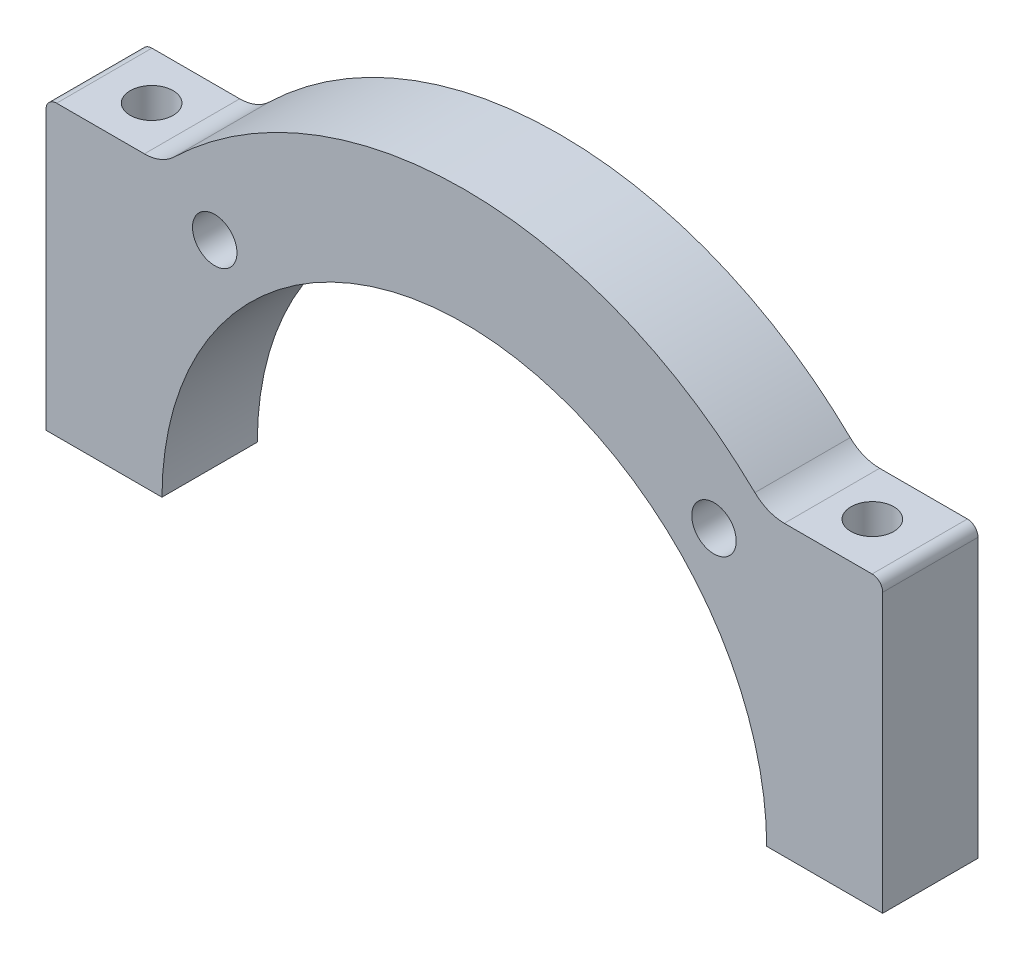
ISO-10303-21;
HEADER;
FILE_DESCRIPTION(('STEP AP214'),'2;1');
FILE_NAME('part.step','',(''),(''),'','','');
FILE_SCHEMA(('AUTOMOTIVE_DESIGN { 1 0 10303 214 1 1 1 1 }'));
ENDSEC;
DATA;
#1=APPLICATION_CONTEXT('core data for automotive mechanical design processes');
#2=APPLICATION_PROTOCOL_DEFINITION('international standard','automotive_design',2000,#1);
#3=PRODUCT_CONTEXT('',#1,'mechanical');
#4=PRODUCT('Part','Part','',(#3));
#5=PRODUCT_RELATED_PRODUCT_CATEGORY('part','',(#4));
#6=PRODUCT_DEFINITION_FORMATION('','',#4);
#7=PRODUCT_DEFINITION_CONTEXT('part definition',#1,'design');
#8=PRODUCT_DEFINITION('design','',#6,#7);
#9=PRODUCT_DEFINITION_SHAPE('','',#8);
#10=(LENGTH_UNIT() NAMED_UNIT(*) SI_UNIT(.MILLI.,.METRE.));
#11=(NAMED_UNIT(*) PLANE_ANGLE_UNIT() SI_UNIT($,.RADIAN.));
#12=(NAMED_UNIT(*) SI_UNIT($,.STERADIAN.) SOLID_ANGLE_UNIT());
#13=UNCERTAINTY_MEASURE_WITH_UNIT(LENGTH_MEASURE(1.E-05),#10,'distance_accuracy_value','');
#14=(GEOMETRIC_REPRESENTATION_CONTEXT(3) GLOBAL_UNCERTAINTY_ASSIGNED_CONTEXT((#13)) GLOBAL_UNIT_ASSIGNED_CONTEXT((#10,
#11,#12)) REPRESENTATION_CONTEXT('',''));
#15=CARTESIAN_POINT('',(0.,0.,0.));
#16=DIRECTION('',(0.,0.,1.));
#17=DIRECTION('',(1.,0.,0.));
#18=AXIS2_PLACEMENT_3D('',#15,#16,#17);
#19=CARTESIAN_POINT('',(34.025,123.51,-4.5));
#20=DIRECTION('',(0.,-1.,0.));
#21=DIRECTION('',(0.,0.,-1.));
#22=AXIS2_PLACEMENT_3D('',#19,#20,#21);
#23=CYLINDRICAL_SURFACE('',#22,2.025);
#24=CARTESIAN_POINT('',(34.025,0.0499999999999945,-4.5));
#25=DIRECTION('',(0.,1.,0.));
#26=DIRECTION('',(-1.,0.,0.));
#27=AXIS2_PLACEMENT_3D('',#24,#25,#26);
#28=CIRCLE('',#27,2.025);
#29=CARTESIAN_POINT('',(32.,0.0499999999999942,-4.5));
#30=VERTEX_POINT('',#29);
#31=EDGE_CURVE('E218',#30,#30,#28,.T.);
#32=ORIENTED_EDGE('',*,*,#31,.F.);
#33=EDGE_LOOP('',(#32));
#34=FACE_BOUND('',#33,.T.);
#35=CARTESIAN_POINT('',(34.025,27.2973899851249,-4.5));
#36=DIRECTION('',(0.,1.,0.));
#37=DIRECTION('',(0.,0.,1.));
#38=AXIS2_PLACEMENT_3D('',#35,#36,#37);
#39=CIRCLE('',#38,2.025);
#40=CARTESIAN_POINT('',(34.025,27.2973899851249,-2.475));
#41=VERTEX_POINT('',#40);
#42=EDGE_CURVE('E204',#41,#41,#39,.T.);
#43=ORIENTED_EDGE('',*,*,#42,.T.);
#44=EDGE_LOOP('',(#43));
#45=FACE_BOUND('',#44,.T.);
#46=ADVANCED_FACE('F16',(#34,#45),#23,.F.);
#47=CARTESIAN_POINT('',(-34.025,123.51,-4.5));
#48=DIRECTION('',(0.,-1.,0.));
#49=DIRECTION('',(0.,0.,-1.));
#50=AXIS2_PLACEMENT_3D('',#47,#48,#49);
#51=CYLINDRICAL_SURFACE('',#50,2.025);
#52=CARTESIAN_POINT('',(-34.025,27.2973899851249,-4.5));
#53=DIRECTION('',(0.,-1.,0.));
#54=DIRECTION('',(0.,0.,-1.));
#55=AXIS2_PLACEMENT_3D('',#52,#53,#54);
#56=CIRCLE('',#55,2.025);
#57=CARTESIAN_POINT('',(-34.025,27.2973899851249,-6.525));
#58=VERTEX_POINT('',#57);
#59=EDGE_CURVE('E178',#58,#58,#56,.T.);
#60=ORIENTED_EDGE('',*,*,#59,.F.);
#61=EDGE_LOOP('',(#60));
#62=FACE_BOUND('',#61,.T.);
#63=CARTESIAN_POINT('',(-34.025,0.0499999999999945,-4.5));
#64=DIRECTION('',(0.,-1.,0.));
#65=DIRECTION('',(0.,0.,-1.));
#66=AXIS2_PLACEMENT_3D('',#63,#64,#65);
#67=CIRCLE('',#66,2.025);
#68=CARTESIAN_POINT('',(-34.025,0.0499999999999945,-6.525));
#69=VERTEX_POINT('',#68);
#70=EDGE_CURVE('E249',#69,#69,#67,.T.);
#71=ORIENTED_EDGE('',*,*,#70,.T.);
#72=EDGE_LOOP('',(#71));
#73=FACE_BOUND('',#72,.T.);
#74=ADVANCED_FACE('F549',(#62,#73),#51,.F.);
#75=CARTESIAN_POINT('',(0.,-12.25,0.));
#76=DIRECTION('',(0.,0.,1.));
#77=DIRECTION('',(1.,0.,0.));
#78=AXIS2_PLACEMENT_3D('',#75,#76,#77);
#79=PLANE('',#78);
#80=CARTESIAN_POINT('',(23.57,23.57,0.));
#81=DIRECTION('',(0.,0.,1.));
#82=DIRECTION('',(1.,0.,0.));
#83=AXIS2_PLACEMENT_3D('',#80,#81,#82);
#84=CIRCLE('',#83,2.1);
#85=CARTESIAN_POINT('',(25.67,23.57,0.));
#86=VERTEX_POINT('',#85);
#87=EDGE_CURVE('E11',#86,#86,#84,.T.);
#88=ORIENTED_EDGE('',*,*,#87,.F.);
#89=EDGE_LOOP('',(#88));
#90=FACE_BOUND('',#89,.T.);
#91=CARTESIAN_POINT('',(-23.57,23.57,0.));
#92=DIRECTION('',(0.,0.,1.));
#93=DIRECTION('',(1.,0.,0.));
#94=AXIS2_PLACEMENT_3D('',#91,#92,#93);
#95=CIRCLE('',#94,2.1);
#96=CARTESIAN_POINT('',(-21.47,23.57,0.));
#97=VERTEX_POINT('',#96);
#98=EDGE_CURVE('E205',#97,#97,#95,.T.);
#99=ORIENTED_EDGE('',*,*,#98,.F.);
#100=EDGE_LOOP('',(#99));
#101=FACE_BOUND('',#100,.T.);
#102=DIRECTION('',(0.,1.,0.));
#103=VECTOR('',#102,1.);
#104=CARTESIAN_POINT('',(-39.4999683544177,13.1736949925625,0.));
#105=LINE('',#104,#103);
#106=CARTESIAN_POINT('',(-39.4999683544177,0.0499999999976821,0.));
#107=VERTEX_POINT('',#106);
#108=CARTESIAN_POINT('',(-39.4999683544177,26.2973899851249,0.));
#109=VERTEX_POINT('',#108);
#110=EDGE_CURVE('E213',#107,#109,#105,.T.);
#111=ORIENTED_EDGE('',*,*,#110,.F.);
#112=DIRECTION('',(1.,0.,0.));
#113=VECTOR('',#112,1.);
#114=CARTESIAN_POINT('',(-34.0249622857735,0.05,0.));
#115=LINE('',#114,#113);
#116=CARTESIAN_POINT('',(-28.5499562171293,0.05,0.));
#117=VERTEX_POINT('',#116);
#118=EDGE_CURVE('E252',#107,#117,#115,.T.);
#119=ORIENTED_EDGE('',*,*,#118,.T.);
#120=CARTESIAN_POINT('',(-9.1919527545059E-11,0.,0.));
#121=DIRECTION('',(0.,0.,1.));
#122=DIRECTION('',(1.,0.,0.));
#123=AXIS2_PLACEMENT_3D('',#120,#121,#122);
#124=CIRCLE('',#123,28.55);
#125=CARTESIAN_POINT('',(28.5499562171293,0.05,0.));
#126=VERTEX_POINT('',#125);
#127=EDGE_CURVE('E284',#126,#117,#124,.T.);
#128=ORIENTED_EDGE('',*,*,#127,.F.);
#129=DIRECTION('',(-1.,0.,0.));
#130=VECTOR('',#129,1.);
#131=CARTESIAN_POINT('',(34.0249622857735,0.05,0.));
#132=LINE('',#131,#130);
#133=CARTESIAN_POINT('',(39.4999683544177,0.050000000002007,0.));
#134=VERTEX_POINT('',#133);
#135=EDGE_CURVE('E223',#134,#126,#132,.T.);
#136=ORIENTED_EDGE('',*,*,#135,.F.);
#137=DIRECTION('',(0.,1.,0.));
#138=VECTOR('',#137,1.);
#139=CARTESIAN_POINT('',(39.4999683544177,13.1736949925625,0.));
#140=LINE('',#139,#138);
#141=CARTESIAN_POINT('',(39.4999683544177,26.2973899851249,0.));
#142=VERTEX_POINT('',#141);
#143=EDGE_CURVE('E245',#134,#142,#140,.T.);
#144=ORIENTED_EDGE('',*,*,#143,.T.);
#145=CARTESIAN_POINT('',(38.4999683544177,26.2973899851249,0.));
#146=DIRECTION('',(0.,0.,-1.));
#147=DIRECTION('',(1.,0.,0.));
#148=AXIS2_PLACEMENT_3D('',#145,#146,#147);
#149=CIRCLE('',#148,1.);
#150=CARTESIAN_POINT('',(38.4999683544177,27.2973899851249,0.));
#151=VERTEX_POINT('',#150);
#152=EDGE_CURVE('E226',#151,#142,#149,.T.);
#153=ORIENTED_EDGE('',*,*,#152,.F.);
#154=DIRECTION('',(-1.,0.,0.));
#155=VECTOR('',#154,1.);
#156=CARTESIAN_POINT('',(34.3556402380938,27.2973899851249,0.));
#157=LINE('',#156,#155);
#158=CARTESIAN_POINT('',(30.2113121217699,27.2973899851249,0.));
#159=VERTEX_POINT('',#158);
#160=EDGE_CURVE('E199',#151,#159,#157,.T.);
#161=ORIENTED_EDGE('',*,*,#160,.T.);
#162=CARTESIAN_POINT('',(30.2113121217699,31.2973899851249,0.));
#163=DIRECTION('',(0.,0.,-1.));
#164=DIRECTION('',(1.,0.,0.));
#165=AXIS2_PLACEMENT_3D('',#162,#163,#164);
#166=CIRCLE('',#165,4.);
#167=CARTESIAN_POINT('',(27.4332604324117,28.4194690669526,0.));
#168=VERTEX_POINT('',#167);
#169=EDGE_CURVE('E258',#159,#168,#166,.T.);
#170=ORIENTED_EDGE('',*,*,#169,.T.);
#171=CARTESIAN_POINT('',(0.,0.,0.));
#172=DIRECTION('',(0.,0.,1.));
#173=DIRECTION('',(1.,0.,0.));
#174=AXIS2_PLACEMENT_3D('',#171,#172,#173);
#175=CIRCLE('',#174,39.5);
#176=CARTESIAN_POINT('',(-27.4332604324117,28.4194690669526,0.));
#177=VERTEX_POINT('',#176);
#178=EDGE_CURVE('E234',#168,#177,#175,.T.);
#179=ORIENTED_EDGE('',*,*,#178,.T.);
#180=CARTESIAN_POINT('',(-30.2113121217699,31.2973899851249,0.));
#181=DIRECTION('',(0.,0.,1.));
#182=DIRECTION('',(1.,0.,0.));
#183=AXIS2_PLACEMENT_3D('',#180,#181,#182);
#184=CIRCLE('',#183,4.);
#185=CARTESIAN_POINT('',(-30.2113121217699,27.2973899851249,0.));
#186=VERTEX_POINT('',#185);
#187=EDGE_CURVE('E132',#186,#177,#184,.T.);
#188=ORIENTED_EDGE('',*,*,#187,.F.);
#189=DIRECTION('',(1.,0.,0.));
#190=VECTOR('',#189,1.);
#191=CARTESIAN_POINT('',(-34.3556402380938,27.2973899851249,0.));
#192=LINE('',#191,#190);
#193=CARTESIAN_POINT('',(-38.4999683544177,27.2973899851249,0.));
#194=VERTEX_POINT('',#193);
#195=EDGE_CURVE('E182',#194,#186,#192,.T.);
#196=ORIENTED_EDGE('',*,*,#195,.F.);
#197=CARTESIAN_POINT('',(-38.4999683544177,26.2973899851249,0.));
#198=DIRECTION('',(0.,0.,1.));
#199=DIRECTION('',(1.,0.,0.));
#200=AXIS2_PLACEMENT_3D('',#197,#198,#199);
#201=CIRCLE('',#200,1.00000000000002);
#202=EDGE_CURVE('E171',#194,#109,#201,.T.);
#203=ORIENTED_EDGE('',*,*,#202,.T.);
#204=EDGE_LOOP('',(#111,#119,#128,#136,#144,#153,#161,#170,#179,#188,#196,#203));
#205=FACE_BOUND('',#204,.T.);
#206=ADVANCED_FACE('F366',(#90,#101,#205),#79,.T.);
#207=CARTESIAN_POINT('',(0.,-12.25,-9.));
#208=DIRECTION('',(0.,0.,1.));
#209=DIRECTION('',(1.,0.,0.));
#210=AXIS2_PLACEMENT_3D('',#207,#208,#209);
#211=PLANE('',#210);
#212=CARTESIAN_POINT('',(23.57,23.57,-9.));
#213=DIRECTION('',(0.,0.,1.));
#214=DIRECTION('',(1.,0.,0.));
#215=AXIS2_PLACEMENT_3D('',#212,#213,#214);
#216=CIRCLE('',#215,2.1);
#217=CARTESIAN_POINT('',(25.67,23.57,-9.));
#218=VERTEX_POINT('',#217);
#219=EDGE_CURVE('E27',#218,#218,#216,.T.);
#220=ORIENTED_EDGE('',*,*,#219,.T.);
#221=EDGE_LOOP('',(#220));
#222=FACE_BOUND('',#221,.T.);
#223=CARTESIAN_POINT('',(-23.57,23.57,-9.));
#224=DIRECTION('',(0.,0.,1.));
#225=DIRECTION('',(1.,0.,0.));
#226=AXIS2_PLACEMENT_3D('',#223,#224,#225);
#227=CIRCLE('',#226,2.1);
#228=CARTESIAN_POINT('',(-21.47,23.57,-9.));
#229=VERTEX_POINT('',#228);
#230=EDGE_CURVE('E208',#229,#229,#227,.T.);
#231=ORIENTED_EDGE('',*,*,#230,.T.);
#232=EDGE_LOOP('',(#231));
#233=FACE_BOUND('',#232,.T.);
#234=DIRECTION('',(0.,1.,0.));
#235=VECTOR('',#234,1.);
#236=CARTESIAN_POINT('',(-39.4999683544177,13.1736949925625,-9.));
#237=LINE('',#236,#235);
#238=CARTESIAN_POINT('',(-39.4999683544177,0.0499999999976821,-9.));
#239=VERTEX_POINT('',#238);
#240=CARTESIAN_POINT('',(-39.4999683544177,26.2973899851249,-9.));
#241=VERTEX_POINT('',#240);
#242=EDGE_CURVE('E212',#239,#241,#237,.T.);
#243=ORIENTED_EDGE('',*,*,#242,.T.);
#244=CARTESIAN_POINT('',(-38.4999683544177,26.2973899851249,-9.));
#245=DIRECTION('',(0.,0.,1.));
#246=DIRECTION('',(1.,0.,0.));
#247=AXIS2_PLACEMENT_3D('',#244,#245,#246);
#248=CIRCLE('',#247,1.00000000000002);
#249=CARTESIAN_POINT('',(-38.4999683544177,27.2973899851249,-9.));
#250=VERTEX_POINT('',#249);
#251=EDGE_CURVE('E222',#250,#241,#248,.T.);
#252=ORIENTED_EDGE('',*,*,#251,.F.);
#253=DIRECTION('',(1.,0.,0.));
#254=VECTOR('',#253,1.);
#255=CARTESIAN_POINT('',(-34.3556402380938,27.2973899851249,-9.));
#256=LINE('',#255,#254);
#257=CARTESIAN_POINT('',(-30.2113121217699,27.2973899851249,-9.));
#258=VERTEX_POINT('',#257);
#259=EDGE_CURVE('E190',#250,#258,#256,.T.);
#260=ORIENTED_EDGE('',*,*,#259,.T.);
#261=CARTESIAN_POINT('',(-30.2113121217699,31.2973899851249,-9.));
#262=DIRECTION('',(0.,0.,1.));
#263=DIRECTION('',(1.,0.,0.));
#264=AXIS2_PLACEMENT_3D('',#261,#262,#263);
#265=CIRCLE('',#264,4.);
#266=CARTESIAN_POINT('',(-27.4332604324117,28.4194690669526,-9.));
#267=VERTEX_POINT('',#266);
#268=EDGE_CURVE('E193',#258,#267,#265,.T.);
#269=ORIENTED_EDGE('',*,*,#268,.T.);
#270=CARTESIAN_POINT('',(0.,0.,-9.));
#271=DIRECTION('',(0.,0.,1.));
#272=DIRECTION('',(1.,0.,0.));
#273=AXIS2_PLACEMENT_3D('',#270,#271,#272);
#274=CIRCLE('',#273,39.5);
#275=CARTESIAN_POINT('',(27.4332604324117,28.4194690669526,-9.));
#276=VERTEX_POINT('',#275);
#277=EDGE_CURVE('E122',#276,#267,#274,.T.);
#278=ORIENTED_EDGE('',*,*,#277,.F.);
#279=CARTESIAN_POINT('',(30.2113121217699,31.2973899851249,-9.));
#280=DIRECTION('',(0.,0.,-1.));
#281=DIRECTION('',(1.,0.,0.));
#282=AXIS2_PLACEMENT_3D('',#279,#280,#281);
#283=CIRCLE('',#282,4.);
#284=CARTESIAN_POINT('',(30.2113121217699,27.2973899851249,-9.));
#285=VERTEX_POINT('',#284);
#286=EDGE_CURVE('E278',#285,#276,#283,.T.);
#287=ORIENTED_EDGE('',*,*,#286,.F.);
#288=DIRECTION('',(-1.,0.,0.));
#289=VECTOR('',#288,1.);
#290=CARTESIAN_POINT('',(34.3556402380938,27.2973899851249,-9.));
#291=LINE('',#290,#289);
#292=CARTESIAN_POINT('',(38.4999683544177,27.2973899851249,-9.));
#293=VERTEX_POINT('',#292);
#294=EDGE_CURVE('E203',#293,#285,#291,.T.);
#295=ORIENTED_EDGE('',*,*,#294,.F.);
#296=CARTESIAN_POINT('',(38.4999683544177,26.2973899851249,-9.));
#297=DIRECTION('',(0.,0.,-1.));
#298=DIRECTION('',(1.,0.,0.));
#299=AXIS2_PLACEMENT_3D('',#296,#297,#298);
#300=CIRCLE('',#299,1.);
#301=CARTESIAN_POINT('',(39.4999683544177,26.2973899851249,-9.));
#302=VERTEX_POINT('',#301);
#303=EDGE_CURVE('E229',#293,#302,#300,.T.);
#304=ORIENTED_EDGE('',*,*,#303,.T.);
#305=DIRECTION('',(0.,1.,0.));
#306=VECTOR('',#305,1.);
#307=CARTESIAN_POINT('',(39.4999683544177,13.1736949925625,-9.));
#308=LINE('',#307,#306);
#309=CARTESIAN_POINT('',(39.4999683544177,0.050000000002007,-9.));
#310=VERTEX_POINT('',#309);
#311=EDGE_CURVE('E261',#310,#302,#308,.T.);
#312=ORIENTED_EDGE('',*,*,#311,.F.);
#313=DIRECTION('',(-1.,0.,0.));
#314=VECTOR('',#313,1.);
#315=CARTESIAN_POINT('',(34.0249622857735,0.05,-9.));
#316=LINE('',#315,#314);
#317=CARTESIAN_POINT('',(28.5499562171293,0.05,-9.));
#318=VERTEX_POINT('',#317);
#319=EDGE_CURVE('E197',#310,#318,#316,.T.);
#320=ORIENTED_EDGE('',*,*,#319,.T.);
#321=CARTESIAN_POINT('',(-9.1919527545059E-11,0.,-9.));
#322=DIRECTION('',(0.,0.,1.));
#323=DIRECTION('',(1.,0.,0.));
#324=AXIS2_PLACEMENT_3D('',#321,#322,#323);
#325=CIRCLE('',#324,28.55);
#326=CARTESIAN_POINT('',(-28.5499562171293,0.05,-9.));
#327=VERTEX_POINT('',#326);
#328=EDGE_CURVE('E219',#318,#327,#325,.T.);
#329=ORIENTED_EDGE('',*,*,#328,.T.);
#330=DIRECTION('',(1.,0.,0.));
#331=VECTOR('',#330,1.);
#332=CARTESIAN_POINT('',(-34.0249622857735,0.05,-9.));
#333=LINE('',#332,#331);
#334=EDGE_CURVE('E280',#239,#327,#333,.T.);
#335=ORIENTED_EDGE('',*,*,#334,.F.);
#336=EDGE_LOOP('',(#243,#252,#260,#269,#278,#287,#295,#304,#312,#320,#329,#335));
#337=FACE_BOUND('',#336,.T.);
#338=ADVANCED_FACE('F318',(#222,#233,#337),#211,.F.);
#339=CARTESIAN_POINT('',(23.57,23.57,-9.));
#340=DIRECTION('',(0.,0.,1.));
#341=DIRECTION('',(1.,0.,0.));
#342=AXIS2_PLACEMENT_3D('',#339,#340,#341);
#343=CYLINDRICAL_SURFACE('',#342,2.1);
#344=ORIENTED_EDGE('',*,*,#87,.T.);
#345=EDGE_LOOP('',(#344));
#346=FACE_BOUND('',#345,.T.);
#347=ORIENTED_EDGE('',*,*,#219,.F.);
#348=EDGE_LOOP('',(#347));
#349=FACE_BOUND('',#348,.T.);
#350=ADVANCED_FACE('F18',(#346,#349),#343,.F.);
#351=CARTESIAN_POINT('',(-38.4999683544177,26.2973899851249,-9.));
#352=DIRECTION('',(0.,0.,1.));
#353=DIRECTION('',(1.,0.,0.));
#354=AXIS2_PLACEMENT_3D('',#351,#352,#353);
#355=CYLINDRICAL_SURFACE('',#354,1.00000000000002);
#356=ORIENTED_EDGE('',*,*,#202,.F.);
#357=DIRECTION('',(0.,0.,1.));
#358=VECTOR('',#357,1.);
#359=CARTESIAN_POINT('',(-38.4999683544177,27.2973899851249,-9.));
#360=LINE('',#359,#358);
#361=EDGE_CURVE('E246',#250,#194,#360,.T.);
#362=ORIENTED_EDGE('',*,*,#361,.F.);
#363=ORIENTED_EDGE('',*,*,#251,.T.);
#364=DIRECTION('',(0.,0.,1.));
#365=VECTOR('',#364,1.);
#366=CARTESIAN_POINT('',(-39.4999683544177,26.2973899851249,-9.));
#367=LINE('',#366,#365);
#368=EDGE_CURVE('E209',#241,#109,#367,.T.);
#369=ORIENTED_EDGE('',*,*,#368,.T.);
#370=EDGE_LOOP('',(#356,#362,#363,#369));
#371=FACE_BOUND('',#370,.T.);
#372=ADVANCED_FACE('F354',(#371),#355,.T.);
#373=CARTESIAN_POINT('',(-23.57,23.57,-9.));
#374=DIRECTION('',(0.,0.,1.));
#375=DIRECTION('',(1.,0.,0.));
#376=AXIS2_PLACEMENT_3D('',#373,#374,#375);
#377=CYLINDRICAL_SURFACE('',#376,2.1);
#378=ORIENTED_EDGE('',*,*,#98,.T.);
#379=EDGE_LOOP('',(#378));
#380=FACE_BOUND('',#379,.T.);
#381=ORIENTED_EDGE('',*,*,#230,.F.);
#382=EDGE_LOOP('',(#381));
#383=FACE_BOUND('',#382,.T.);
#384=ADVANCED_FACE('F483',(#380,#383),#377,.F.);
#385=CARTESIAN_POINT('',(-34.3556402380938,27.2973899851249,-9.));
#386=DIRECTION('',(0.,-1.,0.));
#387=DIRECTION('',(0.,0.,-1.));
#388=AXIS2_PLACEMENT_3D('',#385,#386,#387);
#389=PLANE('',#388);
#390=ORIENTED_EDGE('',*,*,#195,.T.);
#391=DIRECTION('',(0.,0.,1.));
#392=VECTOR('',#391,1.);
#393=CARTESIAN_POINT('',(-30.2113121217699,27.2973899851249,-9.));
#394=LINE('',#393,#392);
#395=EDGE_CURVE('E183',#258,#186,#394,.T.);
#396=ORIENTED_EDGE('',*,*,#395,.F.);
#397=ORIENTED_EDGE('',*,*,#259,.F.);
#398=ORIENTED_EDGE('',*,*,#361,.T.);
#399=EDGE_LOOP('',(#390,#396,#397,#398));
#400=FACE_BOUND('',#399,.T.);
#401=ORIENTED_EDGE('',*,*,#59,.T.);
#402=EDGE_LOOP('',(#401));
#403=FACE_BOUND('',#402,.T.);
#404=ADVANCED_FACE('F179',(#400,#403),#389,.F.);
#405=CARTESIAN_POINT('',(-30.2113121217699,31.2973899851249,-9.));
#406=DIRECTION('',(0.,0.,1.));
#407=DIRECTION('',(1.,0.,0.));
#408=AXIS2_PLACEMENT_3D('',#405,#406,#407);
#409=CYLINDRICAL_SURFACE('',#408,4.);
#410=ORIENTED_EDGE('',*,*,#187,.T.);
#411=DIRECTION('',(0.,0.,1.));
#412=VECTOR('',#411,1.);
#413=CARTESIAN_POINT('',(-27.4332604324117,28.4194690669526,-9.));
#414=LINE('',#413,#412);
#415=EDGE_CURVE('E233',#267,#177,#414,.T.);
#416=ORIENTED_EDGE('',*,*,#415,.F.);
#417=ORIENTED_EDGE('',*,*,#268,.F.);
#418=ORIENTED_EDGE('',*,*,#395,.T.);
#419=EDGE_LOOP('',(#410,#416,#417,#418));
#420=FACE_BOUND('',#419,.T.);
#421=ADVANCED_FACE('F360',(#420),#409,.F.);
#422=CARTESIAN_POINT('',(0.,0.,-9.));
#423=DIRECTION('',(0.,0.,1.));
#424=DIRECTION('',(1.,0.,0.));
#425=AXIS2_PLACEMENT_3D('',#422,#423,#424);
#426=CYLINDRICAL_SURFACE('',#425,39.5);
#427=ORIENTED_EDGE('',*,*,#178,.F.);
#428=DIRECTION('',(0.,0.,1.));
#429=VECTOR('',#428,1.);
#430=CARTESIAN_POINT('',(27.4332604324117,28.4194690669526,-9.));
#431=LINE('',#430,#429);
#432=EDGE_CURVE('E275',#276,#168,#431,.T.);
#433=ORIENTED_EDGE('',*,*,#432,.F.);
#434=ORIENTED_EDGE('',*,*,#277,.T.);
#435=ORIENTED_EDGE('',*,*,#415,.T.);
#436=EDGE_LOOP('',(#427,#433,#434,#435));
#437=FACE_BOUND('',#436,.T.);
#438=ADVANCED_FACE('F364',(#437),#426,.T.);
#439=CARTESIAN_POINT('',(30.2113121217699,31.2973899851249,-9.));
#440=DIRECTION('',(0.,0.,1.));
#441=DIRECTION('',(1.,0.,0.));
#442=AXIS2_PLACEMENT_3D('',#439,#440,#441);
#443=CYLINDRICAL_SURFACE('',#442,4.);
#444=ORIENTED_EDGE('',*,*,#169,.F.);
#445=DIRECTION('',(0.,0.,1.));
#446=VECTOR('',#445,1.);
#447=CARTESIAN_POINT('',(30.2113121217699,27.2973899851249,-9.));
#448=LINE('',#447,#446);
#449=EDGE_CURVE('E254',#285,#159,#448,.T.);
#450=ORIENTED_EDGE('',*,*,#449,.F.);
#451=ORIENTED_EDGE('',*,*,#286,.T.);
#452=ORIENTED_EDGE('',*,*,#432,.T.);
#453=EDGE_LOOP('',(#444,#450,#451,#452));
#454=FACE_BOUND('',#453,.T.);
#455=ADVANCED_FACE('F315',(#454),#443,.F.);
#456=CARTESIAN_POINT('',(34.3556402380938,27.2973899851249,-9.));
#457=DIRECTION('',(0.,1.,0.));
#458=DIRECTION('',(1.,0.,0.));
#459=AXIS2_PLACEMENT_3D('',#456,#457,#458);
#460=PLANE('',#459);
#461=ORIENTED_EDGE('',*,*,#160,.F.);
#462=DIRECTION('',(0.,0.,1.));
#463=VECTOR('',#462,1.);
#464=CARTESIAN_POINT('',(38.4999683544177,27.2973899851249,-9.));
#465=LINE('',#464,#463);
#466=EDGE_CURVE('E266',#293,#151,#465,.T.);
#467=ORIENTED_EDGE('',*,*,#466,.F.);
#468=ORIENTED_EDGE('',*,*,#294,.T.);
#469=ORIENTED_EDGE('',*,*,#449,.T.);
#470=EDGE_LOOP('',(#461,#467,#468,#469));
#471=FACE_BOUND('',#470,.T.);
#472=ORIENTED_EDGE('',*,*,#42,.F.);
#473=EDGE_LOOP('',(#472));
#474=FACE_BOUND('',#473,.T.);
#475=ADVANCED_FACE('F324',(#471,#474),#460,.T.);
#476=CARTESIAN_POINT('',(38.4999683544177,26.2973899851249,-9.));
#477=DIRECTION('',(0.,0.,1.));
#478=DIRECTION('',(1.,0.,0.));
#479=AXIS2_PLACEMENT_3D('',#476,#477,#478);
#480=CYLINDRICAL_SURFACE('',#479,1.);
#481=ORIENTED_EDGE('',*,*,#152,.T.);
#482=DIRECTION('',(0.,0.,1.));
#483=VECTOR('',#482,1.);
#484=CARTESIAN_POINT('',(39.4999683544177,26.2973899851249,-9.));
#485=LINE('',#484,#483);
#486=EDGE_CURVE('E230',#302,#142,#485,.T.);
#487=ORIENTED_EDGE('',*,*,#486,.F.);
#488=ORIENTED_EDGE('',*,*,#303,.F.);
#489=ORIENTED_EDGE('',*,*,#466,.T.);
#490=EDGE_LOOP('',(#481,#487,#488,#489));
#491=FACE_BOUND('',#490,.T.);
#492=ADVANCED_FACE('F328',(#491),#480,.T.);
#493=CARTESIAN_POINT('',(39.4999683544177,13.1736949925625,-9.));
#494=DIRECTION('',(1.,0.,0.));
#495=DIRECTION('',(0.,-1.,0.));
#496=AXIS2_PLACEMENT_3D('',#493,#494,#495);
#497=PLANE('',#496);
#498=ORIENTED_EDGE('',*,*,#143,.F.);
#499=DIRECTION('',(0.,0.,1.));
#500=VECTOR('',#499,1.);
#501=CARTESIAN_POINT('',(39.4999683544177,0.050000000002007,-9.));
#502=LINE('',#501,#500);
#503=EDGE_CURVE('E241',#310,#134,#502,.T.);
#504=ORIENTED_EDGE('',*,*,#503,.F.);
#505=ORIENTED_EDGE('',*,*,#311,.T.);
#506=ORIENTED_EDGE('',*,*,#486,.T.);
#507=EDGE_LOOP('',(#498,#504,#505,#506));
#508=FACE_BOUND('',#507,.T.);
#509=ADVANCED_FACE('F333',(#508),#497,.T.);
#510=CARTESIAN_POINT('',(34.0249622857735,0.05,-9.));
#511=DIRECTION('',(0.,1.,0.));
#512=DIRECTION('',(1.,0.,0.));
#513=AXIS2_PLACEMENT_3D('',#510,#511,#512);
#514=PLANE('',#513);
#515=ORIENTED_EDGE('',*,*,#135,.T.);
#516=DIRECTION('',(0.,0.,1.));
#517=VECTOR('',#516,1.);
#518=CARTESIAN_POINT('',(28.5499562171293,0.05,-9.));
#519=LINE('',#518,#517);
#520=EDGE_CURVE('E214',#318,#126,#519,.T.);
#521=ORIENTED_EDGE('',*,*,#520,.F.);
#522=ORIENTED_EDGE('',*,*,#319,.F.);
#523=ORIENTED_EDGE('',*,*,#503,.T.);
#524=EDGE_LOOP('',(#515,#521,#522,#523));
#525=FACE_BOUND('',#524,.T.);
#526=ORIENTED_EDGE('',*,*,#31,.T.);
#527=EDGE_LOOP('',(#526));
#528=FACE_BOUND('',#527,.T.);
#529=ADVANCED_FACE('F337',(#525,#528),#514,.F.);
#530=CARTESIAN_POINT('',(-9.1919527545059E-11,0.,-9.));
#531=DIRECTION('',(0.,0.,1.));
#532=DIRECTION('',(1.,0.,0.));
#533=AXIS2_PLACEMENT_3D('',#530,#531,#532);
#534=CYLINDRICAL_SURFACE('',#533,28.55);
#535=ORIENTED_EDGE('',*,*,#127,.T.);
#536=DIRECTION('',(0.,0.,1.));
#537=VECTOR('',#536,1.);
#538=CARTESIAN_POINT('',(-28.5499562171293,0.05,-9.));
#539=LINE('',#538,#537);
#540=EDGE_CURVE('E20',#327,#117,#539,.T.);
#541=ORIENTED_EDGE('',*,*,#540,.F.);
#542=ORIENTED_EDGE('',*,*,#328,.F.);
#543=ORIENTED_EDGE('',*,*,#520,.T.);
#544=EDGE_LOOP('',(#535,#541,#542,#543));
#545=FACE_BOUND('',#544,.T.);
#546=ADVANCED_FACE('F340',(#545),#534,.F.);
#547=CARTESIAN_POINT('',(-34.0249622857735,0.05,-9.));
#548=DIRECTION('',(0.,-1.,0.));
#549=DIRECTION('',(0.,0.,-1.));
#550=AXIS2_PLACEMENT_3D('',#547,#548,#549);
#551=PLANE('',#550);
#552=ORIENTED_EDGE('',*,*,#118,.F.);
#553=DIRECTION('',(0.,0.,1.));
#554=VECTOR('',#553,1.);
#555=CARTESIAN_POINT('',(-39.4999683544177,0.0499999999976821,-9.));
#556=LINE('',#555,#554);
#557=EDGE_CURVE('E253',#239,#107,#556,.T.);
#558=ORIENTED_EDGE('',*,*,#557,.F.);
#559=ORIENTED_EDGE('',*,*,#334,.T.);
#560=ORIENTED_EDGE('',*,*,#540,.T.);
#561=EDGE_LOOP('',(#552,#558,#559,#560));
#562=FACE_BOUND('',#561,.T.);
#563=ORIENTED_EDGE('',*,*,#70,.F.);
#564=EDGE_LOOP('',(#563));
#565=FACE_BOUND('',#564,.T.);
#566=ADVANCED_FACE('F344',(#562,#565),#551,.T.);
#567=CARTESIAN_POINT('',(-39.4999683544177,13.1736949925625,-9.));
#568=DIRECTION('',(1.,0.,0.));
#569=DIRECTION('',(0.,1.,0.));
#570=AXIS2_PLACEMENT_3D('',#567,#568,#569);
#571=PLANE('',#570);
#572=ORIENTED_EDGE('',*,*,#110,.T.);
#573=ORIENTED_EDGE('',*,*,#368,.F.);
#574=ORIENTED_EDGE('',*,*,#242,.F.);
#575=ORIENTED_EDGE('',*,*,#557,.T.);
#576=EDGE_LOOP('',(#572,#573,#574,#575));
#577=FACE_BOUND('',#576,.T.);
#578=ADVANCED_FACE('F352',(#577),#571,.F.);
#579=CLOSED_SHELL('',(#46,#74,#206,#338,#350,#372,#384,#404,#421,#438,#455,#475,#492,#509,#529,
#546,#566,#578));
#580=MANIFOLD_SOLID_BREP('B1',#579);
#581=ADVANCED_BREP_SHAPE_REPRESENTATION('',(#18,#580),#14);
#582=SHAPE_DEFINITION_REPRESENTATION(#9,#581);
ENDSEC;
END-ISO-10303-21;
